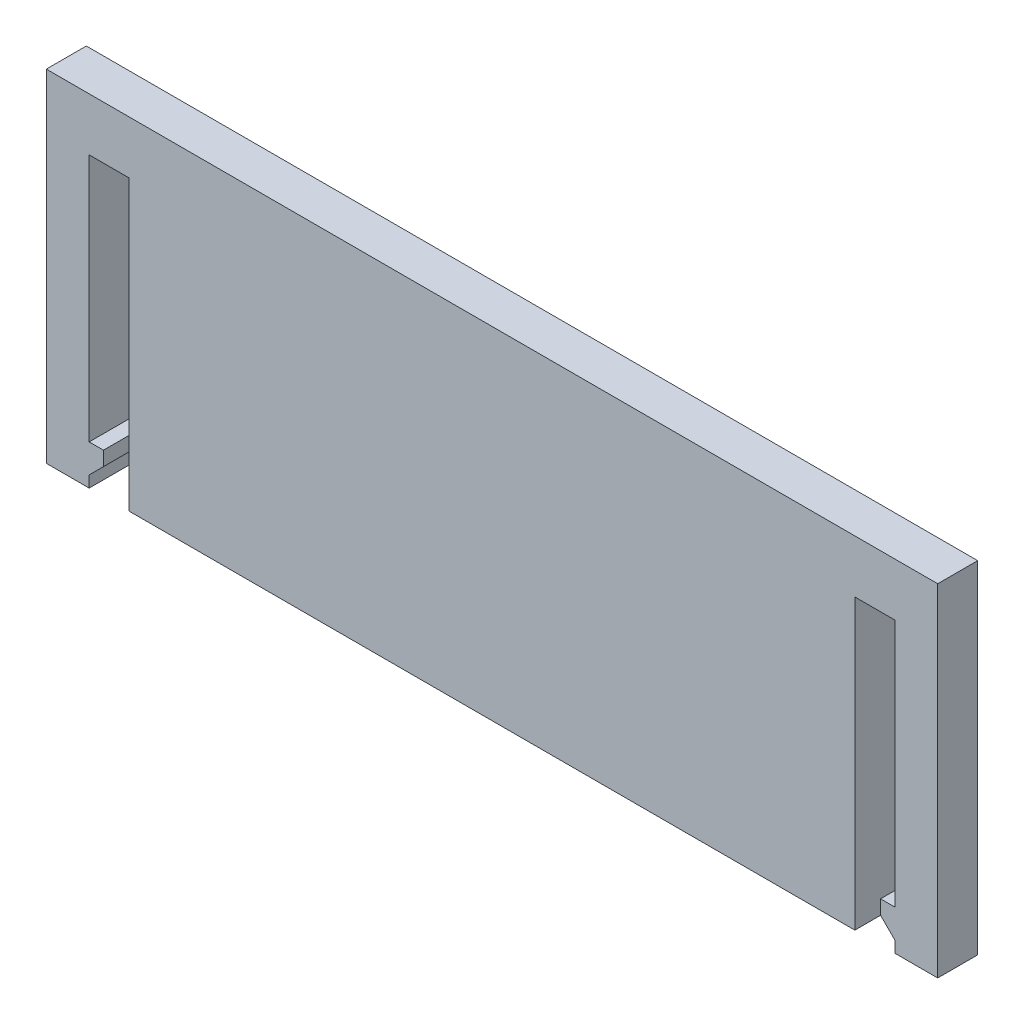
ISO-10303-21;
HEADER;
FILE_DESCRIPTION(('STEP AP214'),'2;1');
FILE_NAME('part.step','',(''),(''),'','','');
FILE_SCHEMA(('AUTOMOTIVE_DESIGN { 1 0 10303 214 1 1 1 1 }'));
ENDSEC;
DATA;
#1=APPLICATION_CONTEXT('core data for automotive mechanical design processes');
#2=APPLICATION_PROTOCOL_DEFINITION('international standard','automotive_design',2000,#1);
#3=PRODUCT_CONTEXT('',#1,'mechanical');
#4=PRODUCT('Part','Part','',(#3));
#5=PRODUCT_RELATED_PRODUCT_CATEGORY('part','',(#4));
#6=PRODUCT_DEFINITION_FORMATION('','',#4);
#7=PRODUCT_DEFINITION_CONTEXT('part definition',#1,'design');
#8=PRODUCT_DEFINITION('design','',#6,#7);
#9=PRODUCT_DEFINITION_SHAPE('','',#8);
#10=(LENGTH_UNIT() NAMED_UNIT(*) SI_UNIT(.MILLI.,.METRE.));
#11=(NAMED_UNIT(*) PLANE_ANGLE_UNIT() SI_UNIT($,.RADIAN.));
#12=(NAMED_UNIT(*) SI_UNIT($,.STERADIAN.) SOLID_ANGLE_UNIT());
#13=UNCERTAINTY_MEASURE_WITH_UNIT(LENGTH_MEASURE(1.E-05),#10,'distance_accuracy_value','');
#14=(GEOMETRIC_REPRESENTATION_CONTEXT(3) GLOBAL_UNCERTAINTY_ASSIGNED_CONTEXT((#13)) GLOBAL_UNIT_ASSIGNED_CONTEXT((#10,
#11,#12)) REPRESENTATION_CONTEXT('',''));
#15=CARTESIAN_POINT('',(0.,0.,0.));
#16=DIRECTION('',(0.,0.,1.));
#17=DIRECTION('',(1.,0.,0.));
#18=AXIS2_PLACEMENT_3D('',#15,#16,#17);
#19=CARTESIAN_POINT('',(0.,0.,1.));
#20=DIRECTION('',(0.,0.,-1.));
#21=DIRECTION('',(-1.,0.,0.));
#22=AXIS2_PLACEMENT_3D('',#19,#20,#21);
#23=PLANE('',#22);
#24=DIRECTION('',(-1.,0.,0.));
#25=VECTOR('',#24,1.);
#26=CARTESIAN_POINT('',(-3.17500000000001,-22.6035845756674,1.));
#27=LINE('',#26,#25);
#28=CARTESIAN_POINT('',(-3.82500000000001,-22.6035845756674,1.));
#29=VERTEX_POINT('',#28);
#30=CARTESIAN_POINT('',(-46.975,-22.6035845756674,1.));
#31=VERTEX_POINT('',#30);
#32=EDGE_CURVE('E242',#29,#31,#27,.T.);
#33=ORIENTED_EDGE('',*,*,#32,.T.);
#34=CARTESIAN_POINT('',(-46.,-21.3035845756673,1.));
#35=DIRECTION('',(0.,0.,1.));
#36=DIRECTION('',(-1.,0.,0.));
#37=AXIS2_PLACEMENT_3D('',#34,#35,#36);
#38=CIRCLE('',#37,1.625);
#39=CARTESIAN_POINT('',(-47.625,-21.3035845756673,1.));
#40=VERTEX_POINT('',#39);
#41=EDGE_CURVE('E52',#40,#31,#38,.T.);
#42=ORIENTED_EDGE('',*,*,#41,.F.);
#43=DIRECTION('',(0.,1.,0.));
#44=VECTOR('',#43,1.);
#45=CARTESIAN_POINT('',(-47.625,-6.09358457566735,1.));
#46=LINE('',#45,#44);
#47=CARTESIAN_POINT('',(-47.625,-7.39358457566735,1.));
#48=VERTEX_POINT('',#47);
#49=EDGE_CURVE('E235',#40,#48,#46,.T.);
#50=ORIENTED_EDGE('',*,*,#49,.T.);
#51=CARTESIAN_POINT('',(-46.,-7.39358457566735,1.));
#52=DIRECTION('',(0.,0.,-1.));
#53=DIRECTION('',(-1.,0.,0.));
#54=AXIS2_PLACEMENT_3D('',#51,#52,#53);
#55=CIRCLE('',#54,1.625);
#56=CARTESIAN_POINT('',(-46.975,-6.09358457566735,1.));
#57=VERTEX_POINT('',#56);
#58=EDGE_CURVE('E836',#48,#57,#55,.T.);
#59=ORIENTED_EDGE('',*,*,#58,.T.);
#60=DIRECTION('',(1.,0.,0.));
#61=VECTOR('',#60,1.);
#62=CARTESIAN_POINT('',(-3.17500000000001,-6.09358457566735,1.));
#63=LINE('',#62,#61);
#64=CARTESIAN_POINT('',(-3.82500000000001,-6.09358457566735,1.));
#65=VERTEX_POINT('',#64);
#66=EDGE_CURVE('E263',#57,#65,#63,.T.);
#67=ORIENTED_EDGE('',*,*,#66,.T.);
#68=CARTESIAN_POINT('',(-4.80000000000001,-7.39358457566735,1.));
#69=DIRECTION('',(0.,0.,1.));
#70=DIRECTION('',(1.,0.,0.));
#71=AXIS2_PLACEMENT_3D('',#68,#69,#70);
#72=CIRCLE('',#71,1.625);
#73=CARTESIAN_POINT('',(-3.17500000000001,-7.39358457566735,1.));
#74=VERTEX_POINT('',#73);
#75=EDGE_CURVE('E248',#74,#65,#72,.T.);
#76=ORIENTED_EDGE('',*,*,#75,.F.);
#77=DIRECTION('',(0.,-1.,0.));
#78=VECTOR('',#77,1.);
#79=CARTESIAN_POINT('',(-3.17500000000001,-6.09358457566735,1.));
#80=LINE('',#79,#78);
#81=CARTESIAN_POINT('',(-3.17500000000001,-21.3035845756674,1.));
#82=VERTEX_POINT('',#81);
#83=EDGE_CURVE('E265',#74,#82,#80,.T.);
#84=ORIENTED_EDGE('',*,*,#83,.T.);
#85=CARTESIAN_POINT('',(-4.80000000000002,-21.3035845756674,1.));
#86=DIRECTION('',(0.,0.,-1.));
#87=DIRECTION('',(1.,0.,0.));
#88=AXIS2_PLACEMENT_3D('',#85,#86,#87);
#89=CIRCLE('',#88,1.625);
#90=EDGE_CURVE('E849',#82,#29,#89,.T.);
#91=ORIENTED_EDGE('',*,*,#90,.T.);
#92=EDGE_LOOP('',(#33,#42,#50,#59,#67,#76,#84,#91));
#93=FACE_BOUND('',#92,.T.);
#94=ADVANCED_FACE('F37',(#93),#23,.T.);
#95=CARTESIAN_POINT('',(-47.625,-6.09358457566735,1.));
#96=DIRECTION('',(-1.,0.,0.));
#97=DIRECTION('',(0.,0.,1.));
#98=AXIS2_PLACEMENT_3D('',#95,#96,#97);
#99=PLANE('',#98);
#100=DIRECTION('',(0.,0.,1.));
#101=VECTOR('',#100,1.);
#102=CARTESIAN_POINT('',(-47.625,-21.3035845756673,-1.45344418537486));
#103=LINE('',#102,#101);
#104=CARTESIAN_POINT('',(-47.625,-21.3035845756673,0.));
#105=VERTEX_POINT('',#104);
#106=EDGE_CURVE('E59',#105,#40,#103,.T.);
#107=ORIENTED_EDGE('',*,*,#106,.F.);
#108=DIRECTION('',(0.,1.,0.));
#109=VECTOR('',#108,1.);
#110=CARTESIAN_POINT('',(-47.625,-6.09358457566735,0.));
#111=LINE('',#110,#109);
#112=CARTESIAN_POINT('',(-47.625,-7.39358457566735,0.));
#113=VERTEX_POINT('',#112);
#114=EDGE_CURVE('E256',#105,#113,#111,.T.);
#115=ORIENTED_EDGE('',*,*,#114,.T.);
#116=DIRECTION('',(0.,0.,1.));
#117=VECTOR('',#116,1.);
#118=CARTESIAN_POINT('',(-47.625,-7.39358457566735,-1.45344418537486));
#119=LINE('',#118,#117);
#120=EDGE_CURVE('E839',#113,#48,#119,.T.);
#121=ORIENTED_EDGE('',*,*,#120,.T.);
#122=ORIENTED_EDGE('',*,*,#49,.F.);
#123=EDGE_LOOP('',(#107,#115,#121,#122));
#124=FACE_BOUND('',#123,.T.);
#125=ADVANCED_FACE('F478',(#124),#99,.F.);
#126=CARTESIAN_POINT('',(-3.17500000000001,-22.6035845756674,1.));
#127=DIRECTION('',(0.,-1.,0.));
#128=DIRECTION('',(0.,0.,-1.));
#129=AXIS2_PLACEMENT_3D('',#126,#127,#128);
#130=PLANE('',#129);
#131=DIRECTION('',(0.,0.,1.));
#132=VECTOR('',#131,1.);
#133=CARTESIAN_POINT('',(-46.975,-22.6035845756673,-1.45344418537486));
#134=LINE('',#133,#132);
#135=CARTESIAN_POINT('',(-46.975,-22.6035845756674,0.));
#136=VERTEX_POINT('',#135);
#137=EDGE_CURVE('E850',#136,#31,#134,.T.);
#138=ORIENTED_EDGE('',*,*,#137,.T.);
#139=ORIENTED_EDGE('',*,*,#32,.F.);
#140=DIRECTION('',(0.,0.,1.));
#141=VECTOR('',#140,1.);
#142=CARTESIAN_POINT('',(-3.82500000000001,-22.6035845756674,-1.45344418537486));
#143=LINE('',#142,#141);
#144=CARTESIAN_POINT('',(-3.82500000000001,-22.6035845756674,0.));
#145=VERTEX_POINT('',#144);
#146=EDGE_CURVE('E240',#145,#29,#143,.T.);
#147=ORIENTED_EDGE('',*,*,#146,.F.);
#148=DIRECTION('',(-1.,0.,0.));
#149=VECTOR('',#148,1.);
#150=CARTESIAN_POINT('',(-3.17500000000001,-22.6035845756674,0.));
#151=LINE('',#150,#149);
#152=EDGE_CURVE('E223',#145,#136,#151,.T.);
#153=ORIENTED_EDGE('',*,*,#152,.T.);
#154=EDGE_LOOP('',(#138,#139,#147,#153));
#155=FACE_BOUND('',#154,.T.);
#156=ADVANCED_FACE('F241',(#155),#130,.F.);
#157=CARTESIAN_POINT('',(-3.17500000000001,-6.09358457566735,1.));
#158=DIRECTION('',(1.,0.,0.));
#159=DIRECTION('',(0.,1.,0.));
#160=AXIS2_PLACEMENT_3D('',#157,#158,#159);
#161=PLANE('',#160);
#162=DIRECTION('',(0.,0.,1.));
#163=VECTOR('',#162,1.);
#164=CARTESIAN_POINT('',(-3.17500000000001,-21.3035845756674,-1.45344418537486));
#165=LINE('',#164,#163);
#166=CARTESIAN_POINT('',(-3.17500000000001,-21.3035845756674,0.));
#167=VERTEX_POINT('',#166);
#168=EDGE_CURVE('E245',#167,#82,#165,.T.);
#169=ORIENTED_EDGE('',*,*,#168,.T.);
#170=ORIENTED_EDGE('',*,*,#83,.F.);
#171=DIRECTION('',(0.,0.,1.));
#172=VECTOR('',#171,1.);
#173=CARTESIAN_POINT('',(-3.17500000000001,-7.39358457566735,-1.45344418537486));
#174=LINE('',#173,#172);
#175=CARTESIAN_POINT('',(-3.17500000000001,-7.39358457566735,0.));
#176=VERTEX_POINT('',#175);
#177=EDGE_CURVE('E257',#176,#74,#174,.T.);
#178=ORIENTED_EDGE('',*,*,#177,.F.);
#179=DIRECTION('',(0.,-1.,0.));
#180=VECTOR('',#179,1.);
#181=CARTESIAN_POINT('',(-3.17500000000001,-6.09358457566735,0.));
#182=LINE('',#181,#180);
#183=EDGE_CURVE('E236',#176,#167,#182,.T.);
#184=ORIENTED_EDGE('',*,*,#183,.T.);
#185=EDGE_LOOP('',(#169,#170,#178,#184));
#186=FACE_BOUND('',#185,.T.);
#187=ADVANCED_FACE('F490',(#186),#161,.F.);
#188=CARTESIAN_POINT('',(-3.17500000000001,-6.09358457566735,1.));
#189=DIRECTION('',(0.,1.,0.));
#190=DIRECTION('',(0.,0.,1.));
#191=AXIS2_PLACEMENT_3D('',#188,#189,#190);
#192=PLANE('',#191);
#193=ORIENTED_EDGE('',*,*,#66,.F.);
#194=DIRECTION('',(0.,0.,1.));
#195=VECTOR('',#194,1.);
#196=CARTESIAN_POINT('',(-46.975,-6.09358457566735,-1.45344418537486));
#197=LINE('',#196,#195);
#198=CARTESIAN_POINT('',(-46.975,-6.09358457566735,0.));
#199=VERTEX_POINT('',#198);
#200=EDGE_CURVE('E831',#199,#57,#197,.T.);
#201=ORIENTED_EDGE('',*,*,#200,.F.);
#202=DIRECTION('',(1.,0.,0.));
#203=VECTOR('',#202,1.);
#204=CARTESIAN_POINT('',(-3.17500000000001,-6.09358457566735,0.));
#205=LINE('',#204,#203);
#206=CARTESIAN_POINT('',(-3.82500000000001,-6.09358457566735,0.));
#207=VERTEX_POINT('',#206);
#208=EDGE_CURVE('E271',#199,#207,#205,.T.);
#209=ORIENTED_EDGE('',*,*,#208,.T.);
#210=DIRECTION('',(0.,0.,1.));
#211=VECTOR('',#210,1.);
#212=CARTESIAN_POINT('',(-3.82500000000001,-6.09358457566735,-1.45344418537486));
#213=LINE('',#212,#211);
#214=EDGE_CURVE('E251',#207,#65,#213,.T.);
#215=ORIENTED_EDGE('',*,*,#214,.T.);
#216=EDGE_LOOP('',(#193,#201,#209,#215));
#217=FACE_BOUND('',#216,.T.);
#218=ADVANCED_FACE('F493',(#217),#192,.F.);
#219=CARTESIAN_POINT('',(0.,0.,2.8));
#220=DIRECTION('',(0.,0.,1.));
#221=DIRECTION('',(1.,0.,0.));
#222=AXIS2_PLACEMENT_3D('',#219,#220,#221);
#223=PLANE('',#222);
#224=DIRECTION('',(1.,0.,0.));
#225=VECTOR('',#224,1.);
#226=CARTESIAN_POINT('',(0.,-23.4997127292713,2.8));
#227=LINE('',#226,#225);
#228=CARTESIAN_POINT('',(1.79999999999999,-23.4997127292713,2.8));
#229=VERTEX_POINT('',#228);
#230=CARTESIAN_POINT('',(2.8,-23.4997127292713,2.8));
#231=VERTEX_POINT('',#230);
#232=EDGE_CURVE('E338',#229,#231,#227,.T.);
#233=ORIENTED_EDGE('',*,*,#232,.F.);
#234=DIRECTION('',(0.,-1.,0.));
#235=VECTOR('',#234,1.);
#236=CARTESIAN_POINT('',(1.79999999999999,0.,2.8));
#237=LINE('',#236,#235);
#238=CARTESIAN_POINT('',(1.79999999999999,-24.4997127292713,2.8));
#239=VERTEX_POINT('',#238);
#240=EDGE_CURVE('E269',#229,#239,#237,.T.);
#241=ORIENTED_EDGE('',*,*,#240,.T.);
#242=DIRECTION('',(0.707106781186549,-0.707106781186546,0.));
#243=VECTOR('',#242,1.);
#244=CARTESIAN_POINT('',(-36.7498563646357,14.0501436353643,2.8));
#245=LINE('',#244,#243);
#246=CARTESIAN_POINT('',(2.79999999999999,-25.4997127292713,2.8));
#247=VERTEX_POINT('',#246);
#248=EDGE_CURVE('E277',#239,#247,#245,.T.);
#249=ORIENTED_EDGE('',*,*,#248,.T.);
#250=DIRECTION('',(0.,-1.,0.));
#251=VECTOR('',#250,1.);
#252=CARTESIAN_POINT('',(2.79999999999999,0.,2.8));
#253=LINE('',#252,#251);
#254=CARTESIAN_POINT('',(2.79999999999999,-26.2997127292713,2.8));
#255=VERTEX_POINT('',#254);
#256=EDGE_CURVE('E284',#247,#255,#253,.T.);
#257=ORIENTED_EDGE('',*,*,#256,.T.);
#258=DIRECTION('',(1.,0.,0.));
#259=VECTOR('',#258,1.);
#260=CARTESIAN_POINT('',(-56.6,-26.2997127292713,2.8));
#261=LINE('',#260,#259);
#262=CARTESIAN_POINT('',(5.8,-26.2997127292713,2.8));
#263=VERTEX_POINT('',#262);
#264=EDGE_CURVE('E394',#255,#263,#261,.T.);
#265=ORIENTED_EDGE('',*,*,#264,.T.);
#266=DIRECTION('',(0.,1.,0.));
#267=VECTOR('',#266,1.);
#268=CARTESIAN_POINT('',(5.8,-2.39745642206338,2.8));
#269=LINE('',#268,#267);
#270=CARTESIAN_POINT('',(5.8,-2.39745642206338,2.8));
#271=VERTEX_POINT('',#270);
#272=EDGE_CURVE('E386',#263,#271,#269,.T.);
#273=ORIENTED_EDGE('',*,*,#272,.T.);
#274=DIRECTION('',(-1.,0.,0.));
#275=VECTOR('',#274,1.);
#276=CARTESIAN_POINT('',(-56.6,-2.39745642206338,2.8));
#277=LINE('',#276,#275);
#278=CARTESIAN_POINT('',(-56.6,-2.39745642206338,2.8));
#279=VERTEX_POINT('',#278);
#280=EDGE_CURVE('E389',#271,#279,#277,.T.);
#281=ORIENTED_EDGE('',*,*,#280,.T.);
#282=DIRECTION('',(0.,-1.,0.));
#283=VECTOR('',#282,1.);
#284=CARTESIAN_POINT('',(-56.6,-2.39745642206338,2.8));
#285=LINE('',#284,#283);
#286=CARTESIAN_POINT('',(-56.6,-26.2997127292713,2.8));
#287=VERTEX_POINT('',#286);
#288=EDGE_CURVE('E392',#279,#287,#285,.T.);
#289=ORIENTED_EDGE('',*,*,#288,.T.);
#290=CARTESIAN_POINT('',(-53.6,-26.2997127292713,2.8));
#291=VERTEX_POINT('',#290);
#292=EDGE_CURVE('E395',#287,#291,#261,.T.);
#293=ORIENTED_EDGE('',*,*,#292,.T.);
#294=DIRECTION('',(0.,-1.,0.));
#295=VECTOR('',#294,1.);
#296=CARTESIAN_POINT('',(-53.6,0.,2.8));
#297=LINE('',#296,#295);
#298=CARTESIAN_POINT('',(-53.6,-25.4997127292713,2.8));
#299=VERTEX_POINT('',#298);
#300=EDGE_CURVE('E306',#299,#291,#297,.T.);
#301=ORIENTED_EDGE('',*,*,#300,.F.);
#302=DIRECTION('',(-0.707106781186549,-0.707106781186546,0.));
#303=VECTOR('',#302,1.);
#304=CARTESIAN_POINT('',(-14.0501436353643,14.0501436353643,2.8));
#305=LINE('',#304,#303);
#306=CARTESIAN_POINT('',(-52.6,-24.4997127292713,2.8));
#307=VERTEX_POINT('',#306);
#308=EDGE_CURVE('E315',#307,#299,#305,.T.);
#309=ORIENTED_EDGE('',*,*,#308,.F.);
#310=DIRECTION('',(0.,-1.,0.));
#311=VECTOR('',#310,1.);
#312=CARTESIAN_POINT('',(-52.6,0.,2.8));
#313=LINE('',#312,#311);
#314=CARTESIAN_POINT('',(-52.6,-23.4997127292713,2.8));
#315=VERTEX_POINT('',#314);
#316=EDGE_CURVE('E292',#315,#307,#313,.T.);
#317=ORIENTED_EDGE('',*,*,#316,.F.);
#318=DIRECTION('',(1.,0.,0.));
#319=VECTOR('',#318,1.);
#320=CARTESIAN_POINT('',(-53.6,-23.4997127292713,2.8));
#321=LINE('',#320,#319);
#322=CARTESIAN_POINT('',(-53.6,-23.4997127292713,2.8));
#323=VERTEX_POINT('',#322);
#324=EDGE_CURVE('E365',#323,#315,#321,.T.);
#325=ORIENTED_EDGE('',*,*,#324,.F.);
#326=DIRECTION('',(0.,-1.,0.));
#327=VECTOR('',#326,1.);
#328=CARTESIAN_POINT('',(-53.6,-6.09745642206336,2.8));
#329=LINE('',#328,#327);
#330=CARTESIAN_POINT('',(-53.6,-6.09745642206336,2.8));
#331=VERTEX_POINT('',#330);
#332=EDGE_CURVE('E362',#331,#323,#329,.T.);
#333=ORIENTED_EDGE('',*,*,#332,.F.);
#334=DIRECTION('',(-1.,0.,0.));
#335=VECTOR('',#334,1.);
#336=CARTESIAN_POINT('',(-53.6,-6.09745642206336,2.8));
#337=LINE('',#336,#335);
#338=CARTESIAN_POINT('',(-50.8,-6.09745642206336,2.8));
#339=VERTEX_POINT('',#338);
#340=EDGE_CURVE('E359',#339,#331,#337,.T.);
#341=ORIENTED_EDGE('',*,*,#340,.F.);
#342=DIRECTION('',(0.,1.,0.));
#343=VECTOR('',#342,1.);
#344=CARTESIAN_POINT('',(-50.8,-6.09745642206336,2.8));
#345=LINE('',#344,#343);
#346=CARTESIAN_POINT('',(-50.8,-26.2997127292713,2.8));
#347=VERTEX_POINT('',#346);
#348=EDGE_CURVE('E357',#347,#339,#345,.T.);
#349=ORIENTED_EDGE('',*,*,#348,.F.);
#350=CARTESIAN_POINT('',(0.,-26.2997127292713,2.8));
#351=VERTEX_POINT('',#350);
#352=EDGE_CURVE('E399',#347,#351,#261,.T.);
#353=ORIENTED_EDGE('',*,*,#352,.T.);
#354=DIRECTION('',(0.,-1.,0.));
#355=VECTOR('',#354,1.);
#356=CARTESIAN_POINT('',(0.,-6.09745642206337,2.8));
#357=LINE('',#356,#355);
#358=CARTESIAN_POINT('',(0.,-6.09745642206337,2.8));
#359=VERTEX_POINT('',#358);
#360=EDGE_CURVE('E336',#359,#351,#357,.T.);
#361=ORIENTED_EDGE('',*,*,#360,.F.);
#362=DIRECTION('',(-1.,0.,0.));
#363=VECTOR('',#362,1.);
#364=CARTESIAN_POINT('',(0.,-6.09745642206337,2.8));
#365=LINE('',#364,#363);
#366=CARTESIAN_POINT('',(2.8,-6.09745642206337,2.8));
#367=VERTEX_POINT('',#366);
#368=EDGE_CURVE('E333',#367,#359,#365,.T.);
#369=ORIENTED_EDGE('',*,*,#368,.F.);
#370=DIRECTION('',(0.,1.,0.));
#371=VECTOR('',#370,1.);
#372=CARTESIAN_POINT('',(2.8,-6.09745642206337,2.8));
#373=LINE('',#372,#371);
#374=EDGE_CURVE('E331',#231,#367,#373,.T.);
#375=ORIENTED_EDGE('',*,*,#374,.F.);
#376=EDGE_LOOP('',(#233,#241,#249,#257,#265,#273,#281,#289,#293,#301,#309,#317,#325,#333,#341,
#349,#353,#361,#369,#375));
#377=FACE_BOUND('',#376,.T.);
#378=ADVANCED_FACE('F432',(#377),#223,.T.);
#379=CARTESIAN_POINT('',(0.,0.,0.));
#380=DIRECTION('',(0.,0.,1.));
#381=DIRECTION('',(1.,0.,0.));
#382=AXIS2_PLACEMENT_3D('',#379,#380,#381);
#383=PLANE('',#382);
#384=ORIENTED_EDGE('',*,*,#114,.F.);
#385=CARTESIAN_POINT('',(-46.,-21.3035845756673,0.));
#386=DIRECTION('',(0.,0.,1.));
#387=DIRECTION('',(1.,0.,0.));
#388=AXIS2_PLACEMENT_3D('',#385,#386,#387);
#389=CIRCLE('',#388,1.625);
#390=EDGE_CURVE('E232',#136,#105,#389,.F.);
#391=ORIENTED_EDGE('',*,*,#390,.F.);
#392=ORIENTED_EDGE('',*,*,#152,.F.);
#393=CARTESIAN_POINT('',(-4.80000000000002,-21.3035845756674,0.));
#394=DIRECTION('',(0.,0.,1.));
#395=DIRECTION('',(1.,0.,0.));
#396=AXIS2_PLACEMENT_3D('',#393,#394,#395);
#397=CIRCLE('',#396,1.625);
#398=EDGE_CURVE('E229',#145,#167,#397,.T.);
#399=ORIENTED_EDGE('',*,*,#398,.T.);
#400=ORIENTED_EDGE('',*,*,#183,.F.);
#401=CARTESIAN_POINT('',(-4.80000000000001,-7.39358457566735,0.));
#402=DIRECTION('',(0.,0.,1.));
#403=DIRECTION('',(1.,0.,0.));
#404=AXIS2_PLACEMENT_3D('',#401,#402,#403);
#405=CIRCLE('',#404,1.625);
#406=EDGE_CURVE('E255',#207,#176,#405,.F.);
#407=ORIENTED_EDGE('',*,*,#406,.F.);
#408=ORIENTED_EDGE('',*,*,#208,.F.);
#409=CARTESIAN_POINT('',(-46.,-7.39358457566735,0.));
#410=DIRECTION('',(0.,0.,1.));
#411=DIRECTION('',(1.,0.,0.));
#412=AXIS2_PLACEMENT_3D('',#409,#410,#411);
#413=CIRCLE('',#412,1.625);
#414=EDGE_CURVE('E847',#199,#113,#413,.T.);
#415=ORIENTED_EDGE('',*,*,#414,.T.);
#416=EDGE_LOOP('',(#384,#391,#392,#399,#400,#407,#408,#415));
#417=FACE_BOUND('',#416,.T.);
#418=DIRECTION('',(0.,-1.,0.));
#419=VECTOR('',#418,1.);
#420=CARTESIAN_POINT('',(1.79999999999999,0.,0.));
#421=LINE('',#420,#419);
#422=CARTESIAN_POINT('',(1.79999999999999,-23.4997127292713,0.));
#423=VERTEX_POINT('',#422);
#424=CARTESIAN_POINT('',(1.79999999999999,-24.4997127292713,0.));
#425=VERTEX_POINT('',#424);
#426=EDGE_CURVE('E274',#423,#425,#421,.T.);
#427=ORIENTED_EDGE('',*,*,#426,.F.);
#428=DIRECTION('',(1.,0.,0.));
#429=VECTOR('',#428,1.);
#430=CARTESIAN_POINT('',(0.,-23.4997127292713,0.));
#431=LINE('',#430,#429);
#432=CARTESIAN_POINT('',(2.8,-23.4997127292713,0.));
#433=VERTEX_POINT('',#432);
#434=EDGE_CURVE('E334',#423,#433,#431,.T.);
#435=ORIENTED_EDGE('',*,*,#434,.T.);
#436=DIRECTION('',(0.,1.,0.));
#437=VECTOR('',#436,1.);
#438=CARTESIAN_POINT('',(2.8,-6.09745642206337,0.));
#439=LINE('',#438,#437);
#440=CARTESIAN_POINT('',(2.8,-6.09745642206337,0.));
#441=VERTEX_POINT('',#440);
#442=EDGE_CURVE('E321',#433,#441,#439,.T.);
#443=ORIENTED_EDGE('',*,*,#442,.T.);
#444=DIRECTION('',(-1.,0.,0.));
#445=VECTOR('',#444,1.);
#446=CARTESIAN_POINT('',(0.,-6.09745642206337,0.));
#447=LINE('',#446,#445);
#448=CARTESIAN_POINT('',(0.,-6.09745642206337,0.));
#449=VERTEX_POINT('',#448);
#450=EDGE_CURVE('E343',#441,#449,#447,.T.);
#451=ORIENTED_EDGE('',*,*,#450,.T.);
#452=DIRECTION('',(0.,-1.,0.));
#453=VECTOR('',#452,1.);
#454=CARTESIAN_POINT('',(0.,-6.09745642206337,0.));
#455=LINE('',#454,#453);
#456=CARTESIAN_POINT('',(0.,-26.2997127292713,0.));
#457=VERTEX_POINT('',#456);
#458=EDGE_CURVE('E346',#449,#457,#455,.T.);
#459=ORIENTED_EDGE('',*,*,#458,.T.);
#460=DIRECTION('',(1.,0.,0.));
#461=VECTOR('',#460,1.);
#462=CARTESIAN_POINT('',(-56.6,-26.2997127292713,0.));
#463=LINE('',#462,#461);
#464=CARTESIAN_POINT('',(-50.8,-26.2997127292713,0.));
#465=VERTEX_POINT('',#464);
#466=EDGE_CURVE('E409',#465,#457,#463,.T.);
#467=ORIENTED_EDGE('',*,*,#466,.F.);
#468=DIRECTION('',(0.,1.,0.));
#469=VECTOR('',#468,1.);
#470=CARTESIAN_POINT('',(-50.8,-6.09745642206336,0.));
#471=LINE('',#470,#469);
#472=CARTESIAN_POINT('',(-50.8,-6.09745642206336,0.));
#473=VERTEX_POINT('',#472);
#474=EDGE_CURVE('E356',#465,#473,#471,.T.);
#475=ORIENTED_EDGE('',*,*,#474,.T.);
#476=DIRECTION('',(-1.,0.,0.));
#477=VECTOR('',#476,1.);
#478=CARTESIAN_POINT('',(-53.6,-6.09745642206336,0.));
#479=LINE('',#478,#477);
#480=CARTESIAN_POINT('',(-53.6,-6.09745642206336,0.));
#481=VERTEX_POINT('',#480);
#482=EDGE_CURVE('E371',#473,#481,#479,.T.);
#483=ORIENTED_EDGE('',*,*,#482,.T.);
#484=DIRECTION('',(0.,-1.,0.));
#485=VECTOR('',#484,1.);
#486=CARTESIAN_POINT('',(-53.6,-6.09745642206336,0.));
#487=LINE('',#486,#485);
#488=CARTESIAN_POINT('',(-53.6,-23.4997127292713,0.));
#489=VERTEX_POINT('',#488);
#490=EDGE_CURVE('E374',#481,#489,#487,.T.);
#491=ORIENTED_EDGE('',*,*,#490,.T.);
#492=DIRECTION('',(1.,0.,0.));
#493=VECTOR('',#492,1.);
#494=CARTESIAN_POINT('',(-53.6,-23.4997127292713,0.));
#495=LINE('',#494,#493);
#496=CARTESIAN_POINT('',(-52.6,-23.4997127292713,0.));
#497=VERTEX_POINT('',#496);
#498=EDGE_CURVE('E360',#489,#497,#495,.T.);
#499=ORIENTED_EDGE('',*,*,#498,.T.);
#500=DIRECTION('',(0.,-1.,0.));
#501=VECTOR('',#500,1.);
#502=CARTESIAN_POINT('',(-52.6,0.,0.));
#503=LINE('',#502,#501);
#504=CARTESIAN_POINT('',(-52.6,-24.4997127292713,0.));
#505=VERTEX_POINT('',#504);
#506=EDGE_CURVE('E302',#497,#505,#503,.T.);
#507=ORIENTED_EDGE('',*,*,#506,.T.);
#508=DIRECTION('',(-0.707106781186549,-0.707106781186546,0.));
#509=VECTOR('',#508,1.);
#510=CARTESIAN_POINT('',(-14.0501436353643,14.0501436353643,0.));
#511=LINE('',#510,#509);
#512=CARTESIAN_POINT('',(-53.6,-25.4997127292713,0.));
#513=VERTEX_POINT('',#512);
#514=EDGE_CURVE('E305',#505,#513,#511,.T.);
#515=ORIENTED_EDGE('',*,*,#514,.T.);
#516=DIRECTION('',(0.,-1.,0.));
#517=VECTOR('',#516,1.);
#518=CARTESIAN_POINT('',(-53.6,0.,0.));
#519=LINE('',#518,#517);
#520=CARTESIAN_POINT('',(-53.6,-26.2997127292713,0.));
#521=VERTEX_POINT('',#520);
#522=EDGE_CURVE('E309',#513,#521,#519,.T.);
#523=ORIENTED_EDGE('',*,*,#522,.T.);
#524=CARTESIAN_POINT('',(-56.6,-26.2997127292713,0.));
#525=VERTEX_POINT('',#524);
#526=EDGE_CURVE('E390',#525,#521,#463,.T.);
#527=ORIENTED_EDGE('',*,*,#526,.F.);
#528=DIRECTION('',(0.,-1.,0.));
#529=VECTOR('',#528,1.);
#530=CARTESIAN_POINT('',(-56.6,-2.39745642206338,0.));
#531=LINE('',#530,#529);
#532=CARTESIAN_POINT('',(-56.6,-2.39745642206338,0.));
#533=VERTEX_POINT('',#532);
#534=EDGE_CURVE('E404',#533,#525,#531,.T.);
#535=ORIENTED_EDGE('',*,*,#534,.F.);
#536=DIRECTION('',(-1.,0.,0.));
#537=VECTOR('',#536,1.);
#538=CARTESIAN_POINT('',(-56.6,-2.39745642206338,0.));
#539=LINE('',#538,#537);
#540=CARTESIAN_POINT('',(5.8,-2.39745642206338,0.));
#541=VERTEX_POINT('',#540);
#542=EDGE_CURVE('E402',#541,#533,#539,.T.);
#543=ORIENTED_EDGE('',*,*,#542,.F.);
#544=DIRECTION('',(0.,1.,0.));
#545=VECTOR('',#544,1.);
#546=CARTESIAN_POINT('',(5.8,-2.39745642206338,0.));
#547=LINE('',#546,#545);
#548=CARTESIAN_POINT('',(5.8,-26.2997127292713,0.));
#549=VERTEX_POINT('',#548);
#550=EDGE_CURVE('E385',#549,#541,#547,.T.);
#551=ORIENTED_EDGE('',*,*,#550,.F.);
#552=CARTESIAN_POINT('',(2.79999999999999,-26.2997127292713,0.));
#553=VERTEX_POINT('',#552);
#554=EDGE_CURVE('E406',#553,#549,#463,.T.);
#555=ORIENTED_EDGE('',*,*,#554,.F.);
#556=DIRECTION('',(0.,-1.,0.));
#557=VECTOR('',#556,1.);
#558=CARTESIAN_POINT('',(2.79999999999999,0.,0.));
#559=LINE('',#558,#557);
#560=CARTESIAN_POINT('',(2.79999999999999,-25.4997127292713,0.));
#561=VERTEX_POINT('',#560);
#562=EDGE_CURVE('E276',#561,#553,#559,.T.);
#563=ORIENTED_EDGE('',*,*,#562,.F.);
#564=DIRECTION('',(0.707106781186549,-0.707106781186546,0.));
#565=VECTOR('',#564,1.);
#566=CARTESIAN_POINT('',(-36.7498563646357,14.0501436353643,0.));
#567=LINE('',#566,#565);
#568=EDGE_CURVE('E279',#425,#561,#567,.T.);
#569=ORIENTED_EDGE('',*,*,#568,.F.);
#570=EDGE_LOOP('',(#427,#435,#443,#451,#459,#467,#475,#483,#491,#499,#507,#515,#523,#527,#535,
#543,#551,#555,#563,#569));
#571=FACE_BOUND('',#570,.T.);
#572=ADVANCED_FACE('F225',(#417,#571),#383,.F.);
#573=CARTESIAN_POINT('',(-56.6,-26.2997127292713,2.8));
#574=DIRECTION('',(0.,1.,0.));
#575=DIRECTION('',(0.,0.,1.));
#576=AXIS2_PLACEMENT_3D('',#573,#574,#575);
#577=PLANE('',#576);
#578=DIRECTION('',(0.,0.,1.));
#579=VECTOR('',#578,1.);
#580=CARTESIAN_POINT('',(2.79999999999999,-26.2997127292713,0.));
#581=LINE('',#580,#579);
#582=EDGE_CURVE('E295',#553,#255,#581,.T.);
#583=ORIENTED_EDGE('',*,*,#582,.F.);
#584=ORIENTED_EDGE('',*,*,#554,.T.);
#585=DIRECTION('',(0.,0.,-1.));
#586=VECTOR('',#585,1.);
#587=CARTESIAN_POINT('',(5.8,-26.2997127292713,2.8));
#588=LINE('',#587,#586);
#589=EDGE_CURVE('E398',#263,#549,#588,.T.);
#590=ORIENTED_EDGE('',*,*,#589,.F.);
#591=ORIENTED_EDGE('',*,*,#264,.F.);
#592=EDGE_LOOP('',(#583,#584,#590,#591));
#593=FACE_BOUND('',#592,.T.);
#594=ADVANCED_FACE('F462',(#593),#577,.F.);
#595=CARTESIAN_POINT('',(0.,-23.4997127292713,2.8));
#596=DIRECTION('',(0.,1.,0.));
#597=DIRECTION('',(0.,0.,1.));
#598=AXIS2_PLACEMENT_3D('',#595,#596,#597);
#599=PLANE('',#598);
#600=ORIENTED_EDGE('',*,*,#434,.F.);
#601=DIRECTION('',(0.,0.,1.));
#602=VECTOR('',#601,1.);
#603=CARTESIAN_POINT('',(1.79999999999999,-23.4997127292713,0.));
#604=LINE('',#603,#602);
#605=EDGE_CURVE('E281',#423,#229,#604,.T.);
#606=ORIENTED_EDGE('',*,*,#605,.T.);
#607=ORIENTED_EDGE('',*,*,#232,.T.);
#608=DIRECTION('',(0.,0.,-1.));
#609=VECTOR('',#608,1.);
#610=CARTESIAN_POINT('',(2.8,-23.4997127292713,2.8));
#611=LINE('',#610,#609);
#612=EDGE_CURVE('E340',#231,#433,#611,.T.);
#613=ORIENTED_EDGE('',*,*,#612,.T.);
#614=EDGE_LOOP('',(#600,#606,#607,#613));
#615=FACE_BOUND('',#614,.T.);
#616=ADVANCED_FACE('F464',(#615),#599,.T.);
#617=ORIENTED_EDGE('',*,*,#466,.T.);
#618=DIRECTION('',(0.,0.,1.));
#619=VECTOR('',#618,1.);
#620=CARTESIAN_POINT('',(0.,-26.2997127292713,0.));
#621=LINE('',#620,#619);
#622=EDGE_CURVE('E297',#457,#351,#621,.T.);
#623=ORIENTED_EDGE('',*,*,#622,.T.);
#624=ORIENTED_EDGE('',*,*,#352,.F.);
#625=DIRECTION('',(0.,0.,1.));
#626=VECTOR('',#625,1.);
#627=CARTESIAN_POINT('',(-50.8,-26.2997127292713,0.));
#628=LINE('',#627,#626);
#629=EDGE_CURVE('E322',#465,#347,#628,.T.);
#630=ORIENTED_EDGE('',*,*,#629,.F.);
#631=EDGE_LOOP('',(#617,#623,#624,#630));
#632=FACE_BOUND('',#631,.T.);
#633=ADVANCED_FACE('F448',(#632),#577,.F.);
#634=CARTESIAN_POINT('',(5.8,-2.39745642206338,2.8));
#635=DIRECTION('',(-1.,0.,0.));
#636=DIRECTION('',(0.,0.,1.));
#637=AXIS2_PLACEMENT_3D('',#634,#635,#636);
#638=PLANE('',#637);
#639=ORIENTED_EDGE('',*,*,#550,.T.);
#640=DIRECTION('',(0.,0.,-1.));
#641=VECTOR('',#640,1.);
#642=CARTESIAN_POINT('',(5.8,-2.39745642206338,2.8));
#643=LINE('',#642,#641);
#644=EDGE_CURVE('E11',#271,#541,#643,.T.);
#645=ORIENTED_EDGE('',*,*,#644,.F.);
#646=ORIENTED_EDGE('',*,*,#272,.F.);
#647=ORIENTED_EDGE('',*,*,#589,.T.);
#648=EDGE_LOOP('',(#639,#645,#646,#647));
#649=FACE_BOUND('',#648,.T.);
#650=ADVANCED_FACE('F39',(#649),#638,.F.);
#651=CARTESIAN_POINT('',(-56.6,-2.39745642206338,2.8));
#652=DIRECTION('',(0.,-1.,0.));
#653=DIRECTION('',(0.,0.,-1.));
#654=AXIS2_PLACEMENT_3D('',#651,#652,#653);
#655=PLANE('',#654);
#656=ORIENTED_EDGE('',*,*,#542,.T.);
#657=DIRECTION('',(0.,0.,-1.));
#658=VECTOR('',#657,1.);
#659=CARTESIAN_POINT('',(-56.6,-2.39745642206338,2.8));
#660=LINE('',#659,#658);
#661=EDGE_CURVE('E45',#279,#533,#660,.T.);
#662=ORIENTED_EDGE('',*,*,#661,.F.);
#663=ORIENTED_EDGE('',*,*,#280,.F.);
#664=ORIENTED_EDGE('',*,*,#644,.T.);
#665=EDGE_LOOP('',(#656,#662,#663,#664));
#666=FACE_BOUND('',#665,.T.);
#667=ADVANCED_FACE('F436',(#666),#655,.F.);
#668=CARTESIAN_POINT('',(-56.6,-2.39745642206338,2.8));
#669=DIRECTION('',(1.,0.,0.));
#670=DIRECTION('',(0.,0.,-1.));
#671=AXIS2_PLACEMENT_3D('',#668,#669,#670);
#672=PLANE('',#671);
#673=ORIENTED_EDGE('',*,*,#534,.T.);
#674=DIRECTION('',(0.,0.,-1.));
#675=VECTOR('',#674,1.);
#676=CARTESIAN_POINT('',(-56.6,-26.2997127292713,2.8));
#677=LINE('',#676,#675);
#678=EDGE_CURVE('E412',#287,#525,#677,.T.);
#679=ORIENTED_EDGE('',*,*,#678,.F.);
#680=ORIENTED_EDGE('',*,*,#288,.F.);
#681=ORIENTED_EDGE('',*,*,#661,.T.);
#682=EDGE_LOOP('',(#673,#679,#680,#681));
#683=FACE_BOUND('',#682,.T.);
#684=ADVANCED_FACE('F419',(#683),#672,.F.);
#685=ORIENTED_EDGE('',*,*,#526,.T.);
#686=DIRECTION('',(0.,0.,1.));
#687=VECTOR('',#686,1.);
#688=CARTESIAN_POINT('',(-53.6,-26.2997127292713,0.));
#689=LINE('',#688,#687);
#690=EDGE_CURVE('E325',#521,#291,#689,.T.);
#691=ORIENTED_EDGE('',*,*,#690,.T.);
#692=ORIENTED_EDGE('',*,*,#292,.F.);
#693=ORIENTED_EDGE('',*,*,#678,.T.);
#694=EDGE_LOOP('',(#685,#691,#692,#693));
#695=FACE_BOUND('',#694,.T.);
#696=ADVANCED_FACE('F427',(#695),#577,.F.);
#697=CARTESIAN_POINT('',(-50.8,-6.09745642206336,2.8));
#698=DIRECTION('',(-1.,0.,0.));
#699=DIRECTION('',(0.,0.,1.));
#700=AXIS2_PLACEMENT_3D('',#697,#698,#699);
#701=PLANE('',#700);
#702=ORIENTED_EDGE('',*,*,#474,.F.);
#703=ORIENTED_EDGE('',*,*,#629,.T.);
#704=ORIENTED_EDGE('',*,*,#348,.T.);
#705=DIRECTION('',(0.,0.,-1.));
#706=VECTOR('',#705,1.);
#707=CARTESIAN_POINT('',(-50.8,-6.09745642206336,2.8));
#708=LINE('',#707,#706);
#709=EDGE_CURVE('E382',#339,#473,#708,.T.);
#710=ORIENTED_EDGE('',*,*,#709,.T.);
#711=EDGE_LOOP('',(#702,#703,#704,#710));
#712=FACE_BOUND('',#711,.T.);
#713=ADVANCED_FACE('F476',(#712),#701,.T.);
#714=CARTESIAN_POINT('',(-53.6,-6.09745642206336,2.8));
#715=DIRECTION('',(0.,-1.,0.));
#716=DIRECTION('',(0.,0.,-1.));
#717=AXIS2_PLACEMENT_3D('',#714,#715,#716);
#718=PLANE('',#717);
#719=ORIENTED_EDGE('',*,*,#482,.F.);
#720=ORIENTED_EDGE('',*,*,#709,.F.);
#721=ORIENTED_EDGE('',*,*,#340,.T.);
#722=DIRECTION('',(0.,0.,-1.));
#723=VECTOR('',#722,1.);
#724=CARTESIAN_POINT('',(-53.6,-6.09745642206336,2.8));
#725=LINE('',#724,#723);
#726=EDGE_CURVE('E380',#331,#481,#725,.T.);
#727=ORIENTED_EDGE('',*,*,#726,.T.);
#728=EDGE_LOOP('',(#719,#720,#721,#727));
#729=FACE_BOUND('',#728,.T.);
#730=ADVANCED_FACE('F539',(#729),#718,.T.);
#731=CARTESIAN_POINT('',(-53.6,-6.09745642206336,2.8));
#732=DIRECTION('',(1.,0.,0.));
#733=DIRECTION('',(0.,0.,-1.));
#734=AXIS2_PLACEMENT_3D('',#731,#732,#733);
#735=PLANE('',#734);
#736=ORIENTED_EDGE('',*,*,#490,.F.);
#737=ORIENTED_EDGE('',*,*,#726,.F.);
#738=ORIENTED_EDGE('',*,*,#332,.T.);
#739=DIRECTION('',(0.,0.,-1.));
#740=VECTOR('',#739,1.);
#741=CARTESIAN_POINT('',(-53.6,-23.4997127292713,2.8));
#742=LINE('',#741,#740);
#743=EDGE_CURVE('E368',#323,#489,#742,.T.);
#744=ORIENTED_EDGE('',*,*,#743,.T.);
#745=EDGE_LOOP('',(#736,#737,#738,#744));
#746=FACE_BOUND('',#745,.T.);
#747=ADVANCED_FACE('F535',(#746),#735,.T.);
#748=CARTESIAN_POINT('',(-53.6,-23.4997127292713,2.8));
#749=DIRECTION('',(0.,1.,0.));
#750=DIRECTION('',(0.,0.,1.));
#751=AXIS2_PLACEMENT_3D('',#748,#749,#750);
#752=PLANE('',#751);
#753=DIRECTION('',(0.,0.,1.));
#754=VECTOR('',#753,1.);
#755=CARTESIAN_POINT('',(-52.6,-23.4997127292713,0.));
#756=LINE('',#755,#754);
#757=EDGE_CURVE('E319',#497,#315,#756,.T.);
#758=ORIENTED_EDGE('',*,*,#757,.F.);
#759=ORIENTED_EDGE('',*,*,#498,.F.);
#760=ORIENTED_EDGE('',*,*,#743,.F.);
#761=ORIENTED_EDGE('',*,*,#324,.T.);
#762=EDGE_LOOP('',(#758,#759,#760,#761));
#763=FACE_BOUND('',#762,.T.);
#764=ADVANCED_FACE('F531',(#763),#752,.T.);
#765=CARTESIAN_POINT('',(2.8,-6.09745642206337,2.8));
#766=DIRECTION('',(-1.,0.,0.));
#767=DIRECTION('',(0.,0.,1.));
#768=AXIS2_PLACEMENT_3D('',#765,#766,#767);
#769=PLANE('',#768);
#770=ORIENTED_EDGE('',*,*,#442,.F.);
#771=ORIENTED_EDGE('',*,*,#612,.F.);
#772=ORIENTED_EDGE('',*,*,#374,.T.);
#773=DIRECTION('',(0.,0.,-1.));
#774=VECTOR('',#773,1.);
#775=CARTESIAN_POINT('',(2.8,-6.09745642206337,2.8));
#776=LINE('',#775,#774);
#777=EDGE_CURVE('E353',#367,#441,#776,.T.);
#778=ORIENTED_EDGE('',*,*,#777,.T.);
#779=EDGE_LOOP('',(#770,#771,#772,#778));
#780=FACE_BOUND('',#779,.T.);
#781=ADVANCED_FACE('F527',(#780),#769,.T.);
#782=CARTESIAN_POINT('',(0.,-6.09745642206337,2.8));
#783=DIRECTION('',(0.,-1.,0.));
#784=DIRECTION('',(0.,0.,-1.));
#785=AXIS2_PLACEMENT_3D('',#782,#783,#784);
#786=PLANE('',#785);
#787=ORIENTED_EDGE('',*,*,#450,.F.);
#788=ORIENTED_EDGE('',*,*,#777,.F.);
#789=ORIENTED_EDGE('',*,*,#368,.T.);
#790=DIRECTION('',(0.,0.,-1.));
#791=VECTOR('',#790,1.);
#792=CARTESIAN_POINT('',(0.,-6.09745642206337,2.8));
#793=LINE('',#792,#791);
#794=EDGE_CURVE('E351',#359,#449,#793,.T.);
#795=ORIENTED_EDGE('',*,*,#794,.T.);
#796=EDGE_LOOP('',(#787,#788,#789,#795));
#797=FACE_BOUND('',#796,.T.);
#798=ADVANCED_FACE('F524',(#797),#786,.T.);
#799=CARTESIAN_POINT('',(0.,-6.09745642206337,2.8));
#800=DIRECTION('',(1.,0.,0.));
#801=DIRECTION('',(0.,0.,-1.));
#802=AXIS2_PLACEMENT_3D('',#799,#800,#801);
#803=PLANE('',#802);
#804=ORIENTED_EDGE('',*,*,#458,.F.);
#805=ORIENTED_EDGE('',*,*,#794,.F.);
#806=ORIENTED_EDGE('',*,*,#360,.T.);
#807=ORIENTED_EDGE('',*,*,#622,.F.);
#808=EDGE_LOOP('',(#804,#805,#806,#807));
#809=FACE_BOUND('',#808,.T.);
#810=ADVANCED_FACE('F455',(#809),#803,.T.);
#811=CARTESIAN_POINT('',(-52.6,0.,0.));
#812=DIRECTION('',(-1.,0.,0.));
#813=DIRECTION('',(0.,0.,1.));
#814=AXIS2_PLACEMENT_3D('',#811,#812,#813);
#815=PLANE('',#814);
#816=ORIENTED_EDGE('',*,*,#316,.T.);
#817=DIRECTION('',(0.,0.,1.));
#818=VECTOR('',#817,1.);
#819=CARTESIAN_POINT('',(-52.6,-24.4997127292713,0.));
#820=LINE('',#819,#818);
#821=EDGE_CURVE('E312',#505,#307,#820,.T.);
#822=ORIENTED_EDGE('',*,*,#821,.F.);
#823=ORIENTED_EDGE('',*,*,#506,.F.);
#824=ORIENTED_EDGE('',*,*,#757,.T.);
#825=EDGE_LOOP('',(#816,#822,#823,#824));
#826=FACE_BOUND('',#825,.T.);
#827=ADVANCED_FACE('F514',(#826),#815,.F.);
#828=CARTESIAN_POINT('',(-53.6,0.,0.));
#829=DIRECTION('',(-1.,0.,0.));
#830=DIRECTION('',(0.,0.,1.));
#831=AXIS2_PLACEMENT_3D('',#828,#829,#830);
#832=PLANE('',#831);
#833=ORIENTED_EDGE('',*,*,#300,.T.);
#834=ORIENTED_EDGE('',*,*,#690,.F.);
#835=ORIENTED_EDGE('',*,*,#522,.F.);
#836=DIRECTION('',(0.,0.,1.));
#837=VECTOR('',#836,1.);
#838=CARTESIAN_POINT('',(-53.6,-25.4997127292713,0.));
#839=LINE('',#838,#837);
#840=EDGE_CURVE('E328',#513,#299,#839,.T.);
#841=ORIENTED_EDGE('',*,*,#840,.T.);
#842=EDGE_LOOP('',(#833,#834,#835,#841));
#843=FACE_BOUND('',#842,.T.);
#844=ADVANCED_FACE('F511',(#843),#832,.F.);
#845=CARTESIAN_POINT('',(-14.0501436353643,14.0501436353643,0.));
#846=DIRECTION('',(-0.707106781186546,0.707106781186549,0.));
#847=DIRECTION('',(-0.707106781186549,-0.707106781186546,0.));
#848=AXIS2_PLACEMENT_3D('',#845,#846,#847);
#849=PLANE('',#848);
#850=ORIENTED_EDGE('',*,*,#308,.T.);
#851=ORIENTED_EDGE('',*,*,#840,.F.);
#852=ORIENTED_EDGE('',*,*,#514,.F.);
#853=ORIENTED_EDGE('',*,*,#821,.T.);
#854=EDGE_LOOP('',(#850,#851,#852,#853));
#855=FACE_BOUND('',#854,.T.);
#856=ADVANCED_FACE('F509',(#855),#849,.F.);
#857=CARTESIAN_POINT('',(1.79999999999999,0.,0.));
#858=DIRECTION('',(-1.,0.,0.));
#859=DIRECTION('',(0.,0.,1.));
#860=AXIS2_PLACEMENT_3D('',#857,#858,#859);
#861=PLANE('',#860);
#862=ORIENTED_EDGE('',*,*,#240,.F.);
#863=ORIENTED_EDGE('',*,*,#605,.F.);
#864=ORIENTED_EDGE('',*,*,#426,.T.);
#865=DIRECTION('',(0.,0.,1.));
#866=VECTOR('',#865,1.);
#867=CARTESIAN_POINT('',(1.79999999999999,-24.4997127292713,0.));
#868=LINE('',#867,#866);
#869=EDGE_CURVE('E289',#425,#239,#868,.T.);
#870=ORIENTED_EDGE('',*,*,#869,.T.);
#871=EDGE_LOOP('',(#862,#863,#864,#870));
#872=FACE_BOUND('',#871,.T.);
#873=ADVANCED_FACE('F502',(#872),#861,.T.);
#874=CARTESIAN_POINT('',(-36.7498563646357,14.0501436353643,0.));
#875=DIRECTION('',(-0.707106781186546,-0.707106781186549,0.));
#876=DIRECTION('',(0.707106781186549,-0.707106781186546,0.));
#877=AXIS2_PLACEMENT_3D('',#874,#875,#876);
#878=PLANE('',#877);
#879=ORIENTED_EDGE('',*,*,#248,.F.);
#880=ORIENTED_EDGE('',*,*,#869,.F.);
#881=ORIENTED_EDGE('',*,*,#568,.T.);
#882=DIRECTION('',(0.,0.,1.));
#883=VECTOR('',#882,1.);
#884=CARTESIAN_POINT('',(2.79999999999999,-25.4997127292713,0.));
#885=LINE('',#884,#883);
#886=EDGE_CURVE('E293',#561,#247,#885,.T.);
#887=ORIENTED_EDGE('',*,*,#886,.T.);
#888=EDGE_LOOP('',(#879,#880,#881,#887));
#889=FACE_BOUND('',#888,.T.);
#890=ADVANCED_FACE('F498',(#889),#878,.T.);
#891=CARTESIAN_POINT('',(2.79999999999999,0.,0.));
#892=DIRECTION('',(-1.,0.,0.));
#893=DIRECTION('',(0.,0.,1.));
#894=AXIS2_PLACEMENT_3D('',#891,#892,#893);
#895=PLANE('',#894);
#896=ORIENTED_EDGE('',*,*,#256,.F.);
#897=ORIENTED_EDGE('',*,*,#886,.F.);
#898=ORIENTED_EDGE('',*,*,#562,.T.);
#899=ORIENTED_EDGE('',*,*,#582,.T.);
#900=EDGE_LOOP('',(#896,#897,#898,#899));
#901=FACE_BOUND('',#900,.T.);
#902=ADVANCED_FACE('F501',(#901),#895,.T.);
#903=CARTESIAN_POINT('',(-4.80000000000001,-7.39358457566735,-1.45344418537486));
#904=DIRECTION('',(0.,0.,1.));
#905=DIRECTION('',(1.,0.,0.));
#906=AXIS2_PLACEMENT_3D('',#903,#904,#905);
#907=CYLINDRICAL_SURFACE('',#906,1.625);
#908=ORIENTED_EDGE('',*,*,#214,.F.);
#909=ORIENTED_EDGE('',*,*,#406,.T.);
#910=ORIENTED_EDGE('',*,*,#177,.T.);
#911=ORIENTED_EDGE('',*,*,#75,.T.);
#912=EDGE_LOOP('',(#908,#909,#910,#911));
#913=FACE_BOUND('',#912,.T.);
#914=ADVANCED_FACE('F486',(#913),#907,.F.);
#915=CARTESIAN_POINT('',(-4.80000000000002,-21.3035845756674,-1.45344418537486));
#916=DIRECTION('',(0.,0.,1.));
#917=DIRECTION('',(1.,0.,0.));
#918=AXIS2_PLACEMENT_3D('',#915,#916,#917);
#919=CYLINDRICAL_SURFACE('',#918,1.625);
#920=ORIENTED_EDGE('',*,*,#398,.F.);
#921=ORIENTED_EDGE('',*,*,#146,.T.);
#922=ORIENTED_EDGE('',*,*,#90,.F.);
#923=ORIENTED_EDGE('',*,*,#168,.F.);
#924=EDGE_LOOP('',(#920,#921,#922,#923));
#925=FACE_BOUND('',#924,.T.);
#926=ADVANCED_FACE('F247',(#925),#919,.F.);
#927=CARTESIAN_POINT('',(-46.,-7.39358457566735,-1.45344418537486));
#928=DIRECTION('',(0.,0.,1.));
#929=DIRECTION('',(1.,0.,0.));
#930=AXIS2_PLACEMENT_3D('',#927,#928,#929);
#931=CYLINDRICAL_SURFACE('',#930,1.625);
#932=ORIENTED_EDGE('',*,*,#414,.F.);
#933=ORIENTED_EDGE('',*,*,#200,.T.);
#934=ORIENTED_EDGE('',*,*,#58,.F.);
#935=ORIENTED_EDGE('',*,*,#120,.F.);
#936=EDGE_LOOP('',(#932,#933,#934,#935));
#937=FACE_BOUND('',#936,.T.);
#938=ADVANCED_FACE('F570',(#937),#931,.F.);
#939=CARTESIAN_POINT('',(-46.,-21.3035845756673,-1.45344418537486));
#940=DIRECTION('',(0.,0.,1.));
#941=DIRECTION('',(1.,0.,0.));
#942=AXIS2_PLACEMENT_3D('',#939,#940,#941);
#943=CYLINDRICAL_SURFACE('',#942,1.625);
#944=ORIENTED_EDGE('',*,*,#137,.F.);
#945=ORIENTED_EDGE('',*,*,#390,.T.);
#946=ORIENTED_EDGE('',*,*,#106,.T.);
#947=ORIENTED_EDGE('',*,*,#41,.T.);
#948=EDGE_LOOP('',(#944,#945,#946,#947));
#949=FACE_BOUND('',#948,.T.);
#950=ADVANCED_FACE('F580',(#949),#943,.F.);
#951=CLOSED_SHELL('',(#94,#125,#156,#187,#218,#378,#572,#594,#616,#633,#650,#667,#684,#696,#713,
#730,#747,#764,#781,#798,#810,#827,#844,#856,#873,#890,#902,#914,#926,#938,#950));
#952=MANIFOLD_SOLID_BREP('B2',#951);
#953=ADVANCED_BREP_SHAPE_REPRESENTATION('',(#18,#952),#14);
#954=SHAPE_DEFINITION_REPRESENTATION(#9,#953);
ENDSEC;
END-ISO-10303-21;
